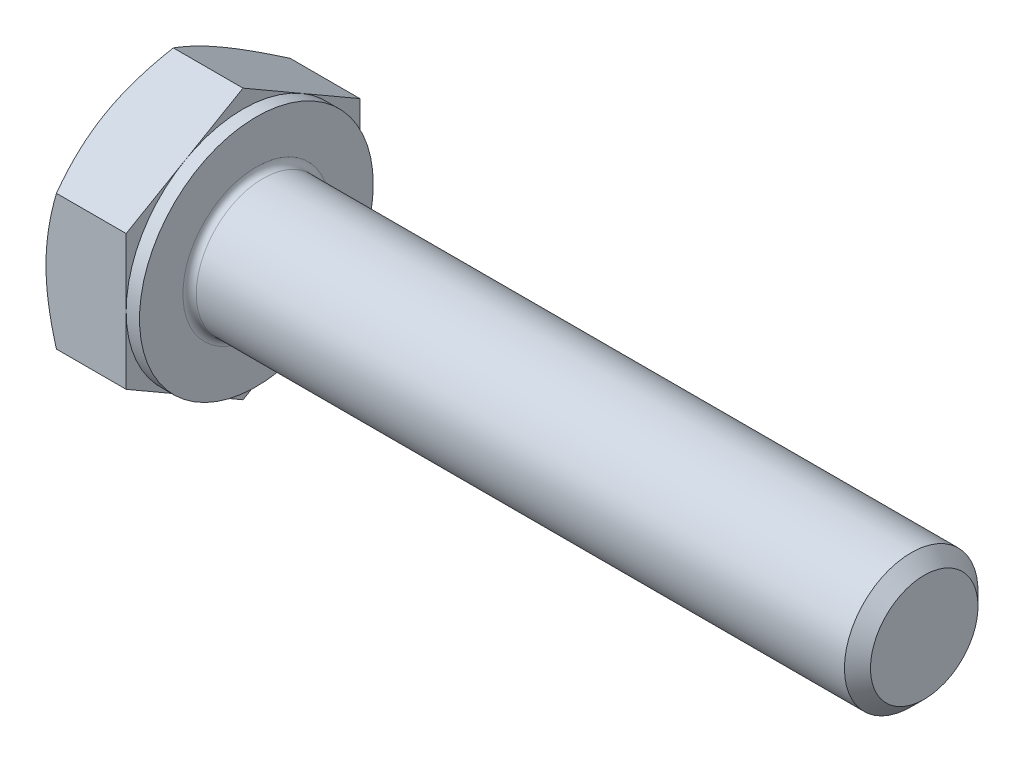
ISO-10303-21;
HEADER;
FILE_DESCRIPTION(('STEP AP214'),'2;1');
FILE_NAME('part.step','',(''),(''),'','','');
FILE_SCHEMA(('AUTOMOTIVE_DESIGN { 1 0 10303 214 1 1 1 1 }'));
ENDSEC;
DATA;
#1=APPLICATION_CONTEXT('core data for automotive mechanical design processes');
#2=APPLICATION_PROTOCOL_DEFINITION('international standard','automotive_design',2000,#1);
#3=PRODUCT_CONTEXT('',#1,'mechanical');
#4=PRODUCT('Part','Part','',(#3));
#5=PRODUCT_RELATED_PRODUCT_CATEGORY('part','',(#4));
#6=PRODUCT_DEFINITION_FORMATION('','',#4);
#7=PRODUCT_DEFINITION_CONTEXT('part definition',#1,'design');
#8=PRODUCT_DEFINITION('design','',#6,#7);
#9=PRODUCT_DEFINITION_SHAPE('','',#8);
#10=(LENGTH_UNIT() NAMED_UNIT(*) SI_UNIT(.MILLI.,.METRE.));
#11=(NAMED_UNIT(*) PLANE_ANGLE_UNIT() SI_UNIT($,.RADIAN.));
#12=(NAMED_UNIT(*) SI_UNIT($,.STERADIAN.) SOLID_ANGLE_UNIT());
#13=UNCERTAINTY_MEASURE_WITH_UNIT(LENGTH_MEASURE(1.E-05),#10,'distance_accuracy_value','');
#14=(GEOMETRIC_REPRESENTATION_CONTEXT(3) GLOBAL_UNCERTAINTY_ASSIGNED_CONTEXT((#13)) GLOBAL_UNIT_ASSIGNED_CONTEXT((#10,
#11,#12)) REPRESENTATION_CONTEXT('',''));
#15=CARTESIAN_POINT('',(0.,0.,0.));
#16=DIRECTION('',(0.,0.,1.));
#17=DIRECTION('',(1.,0.,0.));
#18=AXIS2_PLACEMENT_3D('',#15,#16,#17);
#19=CARTESIAN_POINT('',(2.8,4.04145188432738,0.));
#20=DIRECTION('',(1.,0.,0.));
#21=DIRECTION('',(0.,0.,-1.));
#22=AXIS2_PLACEMENT_3D('',#19,#20,#21);
#23=PLANE('',#22);
#24=CARTESIAN_POINT('',(2.8,0.,0.));
#25=DIRECTION('',(1.,0.,0.));
#26=DIRECTION('',(0.,0.,-1.));
#27=AXIS2_PLACEMENT_3D('',#24,#25,#26);
#28=CIRCLE('',#27,2.2);
#29=CARTESIAN_POINT('',(2.8,0.,-2.2));
#30=VERTEX_POINT('',#29);
#31=EDGE_CURVE('E42',#30,#30,#28,.F.);
#32=ORIENTED_EDGE('',*,*,#31,.T.);
#33=EDGE_LOOP('',(#32));
#34=FACE_BOUND('',#33,.T.);
#35=CARTESIAN_POINT('',(2.8,0.,0.));
#36=DIRECTION('',(1.,0.,0.));
#37=DIRECTION('',(0.,0.,-1.));
#38=AXIS2_PLACEMENT_3D('',#35,#36,#37);
#39=CIRCLE('',#38,3.5);
#40=CARTESIAN_POINT('',(2.8,0.,-3.5));
#41=VERTEX_POINT('',#40);
#42=EDGE_CURVE('E293',#41,#41,#39,.T.);
#43=ORIENTED_EDGE('',*,*,#42,.T.);
#44=EDGE_LOOP('',(#43));
#45=FACE_BOUND('',#44,.T.);
#46=ADVANCED_FACE('F34',(#34,#45),#23,.T.);
#47=CARTESIAN_POINT('',(0.,0.,0.));
#48=DIRECTION('',(-1.,0.,0.));
#49=DIRECTION('',(0.,0.,1.));
#50=AXIS2_PLACEMENT_3D('',#47,#48,#49);
#51=CYLINDRICAL_SURFACE('',#50,2.);
#52=CARTESIAN_POINT('',(3.,0.,0.));
#53=DIRECTION('',(1.,0.,0.));
#54=DIRECTION('',(0.,0.,-1.));
#55=AXIS2_PLACEMENT_3D('',#52,#53,#54);
#56=CIRCLE('',#55,2.);
#57=CARTESIAN_POINT('',(3.,0.,-2.));
#58=VERTEX_POINT('',#57);
#59=EDGE_CURVE('E11',#58,#58,#56,.T.);
#60=ORIENTED_EDGE('',*,*,#59,.T.);
#61=EDGE_LOOP('',(#60));
#62=FACE_BOUND('',#61,.T.);
#63=CARTESIAN_POINT('',(22.41,0.,0.));
#64=DIRECTION('',(-1.,0.,0.));
#65=DIRECTION('',(0.,0.,1.));
#66=AXIS2_PLACEMENT_3D('',#63,#64,#65);
#67=CIRCLE('',#66,2.);
#68=CARTESIAN_POINT('',(22.41,0.,2.));
#69=VERTEX_POINT('',#68);
#70=EDGE_CURVE('E272',#69,#69,#67,.T.);
#71=ORIENTED_EDGE('',*,*,#70,.T.);
#72=EDGE_LOOP('',(#71));
#73=FACE_BOUND('',#72,.T.);
#74=ADVANCED_FACE('F246',(#62,#73),#51,.T.);
#75=CARTESIAN_POINT('',(22.8,0.,0.));
#76=DIRECTION('',(-1.,0.,0.));
#77=DIRECTION('',(0.,0.,1.));
#78=AXIS2_PLACEMENT_3D('',#75,#76,#77);
#79=CONICAL_SURFACE('',#78,1.61,0.785398163397438);
#80=ORIENTED_EDGE('',*,*,#70,.F.);
#81=EDGE_LOOP('',(#80));
#82=FACE_BOUND('',#81,.T.);
#83=CARTESIAN_POINT('',(22.8,0.,0.));
#84=DIRECTION('',(-1.,0.,0.));
#85=DIRECTION('',(0.,0.,1.));
#86=AXIS2_PLACEMENT_3D('',#83,#84,#85);
#87=CIRCLE('',#86,1.61);
#88=CARTESIAN_POINT('',(22.8,0.,1.61));
#89=VERTEX_POINT('',#88);
#90=EDGE_CURVE('E270',#89,#89,#87,.T.);
#91=ORIENTED_EDGE('',*,*,#90,.T.);
#92=EDGE_LOOP('',(#91));
#93=FACE_BOUND('',#92,.T.);
#94=ADVANCED_FACE('F251',(#82,#93),#79,.T.);
#95=CARTESIAN_POINT('',(22.8,0.,0.));
#96=DIRECTION('',(-1.,0.,0.));
#97=DIRECTION('',(0.,0.,1.));
#98=AXIS2_PLACEMENT_3D('',#95,#96,#97);
#99=PLANE('',#98);
#100=ORIENTED_EDGE('',*,*,#90,.F.);
#101=EDGE_LOOP('',(#100));
#102=FACE_BOUND('',#101,.T.);
#103=ADVANCED_FACE('F258',(#102),#99,.F.);
#104=CARTESIAN_POINT('',(2.4,3.5,0.));
#105=DIRECTION('',(1.,0.,0.));
#106=DIRECTION('',(0.,0.,-1.));
#107=AXIS2_PLACEMENT_3D('',#104,#105,#106);
#108=PLANE('',#107);
#109=DIRECTION('',(0.,0.500000000000001,0.866025403784438));
#110=VECTOR('',#109,1.);
#111=CARTESIAN_POINT('',(2.4,2.02072594216369,-3.5));
#112=LINE('',#111,#110);
#113=CARTESIAN_POINT('',(2.4,2.02072594216369,-3.5));
#114=VERTEX_POINT('',#113);
#115=CARTESIAN_POINT('',(2.4,3.03108891324553,-1.75));
#116=VERTEX_POINT('',#115);
#117=EDGE_CURVE('E166',#114,#116,#112,.T.);
#118=ORIENTED_EDGE('',*,*,#117,.T.);
#119=CARTESIAN_POINT('',(2.4,0.,0.));
#120=DIRECTION('',(-1.,0.,0.));
#121=DIRECTION('',(0.,0.,1.));
#122=AXIS2_PLACEMENT_3D('',#119,#120,#121);
#123=CIRCLE('',#122,3.5);
#124=CARTESIAN_POINT('',(2.4,0.,-3.5));
#125=VERTEX_POINT('',#124);
#126=EDGE_CURVE('E49',#116,#125,#123,.T.);
#127=ORIENTED_EDGE('',*,*,#126,.T.);
#128=DIRECTION('',(0.,1.,0.));
#129=VECTOR('',#128,1.);
#130=CARTESIAN_POINT('',(2.4,2.02072594216369,-3.5));
#131=LINE('',#130,#129);
#132=EDGE_CURVE('E296',#125,#114,#131,.T.);
#133=ORIENTED_EDGE('',*,*,#132,.T.);
#134=EDGE_LOOP('',(#118,#127,#133));
#135=FACE_BOUND('',#134,.T.);
#136=ADVANCED_FACE('F261',(#135),#108,.T.);
#137=CARTESIAN_POINT('',(2.4,4.04145188432738,0.));
#138=VERTEX_POINT('',#137);
#139=EDGE_CURVE('E164',#116,#138,#112,.T.);
#140=ORIENTED_EDGE('',*,*,#139,.T.);
#141=DIRECTION('',(0.,-0.500000000000001,0.866025403784438));
#142=VECTOR('',#141,1.);
#143=CARTESIAN_POINT('',(2.4,4.04145188432738,0.));
#144=LINE('',#143,#142);
#145=CARTESIAN_POINT('',(2.4,3.03108891324553,1.75));
#146=VERTEX_POINT('',#145);
#147=EDGE_CURVE('E163',#138,#146,#144,.T.);
#148=ORIENTED_EDGE('',*,*,#147,.T.);
#149=EDGE_CURVE('E152',#146,#116,#123,.T.);
#150=ORIENTED_EDGE('',*,*,#149,.T.);
#151=EDGE_LOOP('',(#140,#148,#150));
#152=FACE_BOUND('',#151,.T.);
#153=ADVANCED_FACE('F266',(#152),#108,.T.);
#154=CARTESIAN_POINT('',(2.4,2.02072594216369,3.5));
#155=VERTEX_POINT('',#154);
#156=EDGE_CURVE('E131',#146,#155,#144,.T.);
#157=ORIENTED_EDGE('',*,*,#156,.T.);
#158=DIRECTION('',(0.,-1.,0.));
#159=VECTOR('',#158,1.);
#160=CARTESIAN_POINT('',(2.4,2.02072594216369,3.5));
#161=LINE('',#160,#159);
#162=CARTESIAN_POINT('',(2.4,0.,3.5));
#163=VERTEX_POINT('',#162);
#164=EDGE_CURVE('E125',#155,#163,#161,.T.);
#165=ORIENTED_EDGE('',*,*,#164,.T.);
#166=EDGE_CURVE('E129',#163,#146,#123,.T.);
#167=ORIENTED_EDGE('',*,*,#166,.T.);
#168=EDGE_LOOP('',(#157,#165,#167));
#169=FACE_BOUND('',#168,.T.);
#170=ADVANCED_FACE('F127',(#169),#108,.T.);
#171=CARTESIAN_POINT('',(2.4,-2.02072594216369,3.5));
#172=VERTEX_POINT('',#171);
#173=EDGE_CURVE('E135',#163,#172,#161,.T.);
#174=ORIENTED_EDGE('',*,*,#173,.T.);
#175=DIRECTION('',(0.,-0.500000000000001,-0.866025403784438));
#176=VECTOR('',#175,1.);
#177=CARTESIAN_POINT('',(2.4,-4.04145188432739,0.));
#178=LINE('',#177,#176);
#179=CARTESIAN_POINT('',(2.4,-3.03108891324553,1.75));
#180=VERTEX_POINT('',#179);
#181=EDGE_CURVE('E142',#172,#180,#178,.T.);
#182=ORIENTED_EDGE('',*,*,#181,.T.);
#183=EDGE_CURVE('E139',#180,#163,#123,.T.);
#184=ORIENTED_EDGE('',*,*,#183,.T.);
#185=EDGE_LOOP('',(#174,#182,#184));
#186=FACE_BOUND('',#185,.T.);
#187=ADVANCED_FACE('F140',(#186),#108,.T.);
#188=CARTESIAN_POINT('',(2.4,-4.04145188432739,0.));
#189=VERTEX_POINT('',#188);
#190=EDGE_CURVE('E158',#180,#189,#178,.T.);
#191=ORIENTED_EDGE('',*,*,#190,.T.);
#192=DIRECTION('',(0.,0.500000000000001,-0.866025403784438));
#193=VECTOR('',#192,1.);
#194=CARTESIAN_POINT('',(2.4,-2.0207259421637,-3.5));
#195=LINE('',#194,#193);
#196=CARTESIAN_POINT('',(2.4,-3.03108891324553,-1.75));
#197=VERTEX_POINT('',#196);
#198=EDGE_CURVE('E334',#189,#197,#195,.T.);
#199=ORIENTED_EDGE('',*,*,#198,.T.);
#200=EDGE_CURVE('E146',#197,#180,#123,.T.);
#201=ORIENTED_EDGE('',*,*,#200,.T.);
#202=EDGE_LOOP('',(#191,#199,#201));
#203=FACE_BOUND('',#202,.T.);
#204=ADVANCED_FACE('F335',(#203),#108,.T.);
#205=CARTESIAN_POINT('',(2.4,-2.0207259421637,-3.5));
#206=VERTEX_POINT('',#205);
#207=EDGE_CURVE('E153',#197,#206,#195,.T.);
#208=ORIENTED_EDGE('',*,*,#207,.T.);
#209=EDGE_CURVE('E297',#206,#125,#131,.T.);
#210=ORIENTED_EDGE('',*,*,#209,.T.);
#211=EDGE_CURVE('E304',#125,#197,#123,.T.);
#212=ORIENTED_EDGE('',*,*,#211,.T.);
#213=EDGE_LOOP('',(#208,#210,#212));
#214=FACE_BOUND('',#213,.T.);
#215=ADVANCED_FACE('F267',(#214),#108,.T.);
#216=CARTESIAN_POINT('',(0.,0.,0.));
#217=DIRECTION('',(-1.,0.,0.));
#218=DIRECTION('',(0.,0.,1.));
#219=AXIS2_PLACEMENT_3D('',#216,#217,#218);
#220=CYLINDRICAL_SURFACE('',#219,3.5);
#221=ORIENTED_EDGE('',*,*,#126,.F.);
#222=ORIENTED_EDGE('',*,*,#149,.F.);
#223=ORIENTED_EDGE('',*,*,#166,.F.);
#224=ORIENTED_EDGE('',*,*,#183,.F.);
#225=ORIENTED_EDGE('',*,*,#200,.F.);
#226=ORIENTED_EDGE('',*,*,#211,.F.);
#227=EDGE_LOOP('',(#221,#222,#223,#224,#225,#226));
#228=FACE_BOUND('',#227,.T.);
#229=ORIENTED_EDGE('',*,*,#42,.F.);
#230=EDGE_LOOP('',(#229));
#231=FACE_BOUND('',#230,.T.);
#232=ADVANCED_FACE('F149',(#228,#231),#220,.T.);
#233=CARTESIAN_POINT('',(0.,4.04145188432738,0.));
#234=DIRECTION('',(1.,0.,0.));
#235=DIRECTION('',(0.,0.,-1.));
#236=AXIS2_PLACEMENT_3D('',#233,#234,#235);
#237=PLANE('',#236);
#238=CARTESIAN_POINT('',(0.,0.,0.));
#239=DIRECTION('',(1.,0.,0.));
#240=DIRECTION('',(0.,0.,-1.));
#241=AXIS2_PLACEMENT_3D('',#238,#239,#240);
#242=CIRCLE('',#241,3.5);
#243=CARTESIAN_POINT('',(0.,0.,-3.5));
#244=VERTEX_POINT('',#243);
#245=CARTESIAN_POINT('',(0.,3.03108891324553,-1.75));
#246=VERTEX_POINT('',#245);
#247=EDGE_CURVE('E292',#244,#246,#242,.T.);
#248=ORIENTED_EDGE('',*,*,#247,.F.);
#249=CARTESIAN_POINT('',(0.,-3.03108891324553,-1.75));
#250=VERTEX_POINT('',#249);
#251=EDGE_CURVE('E288',#250,#244,#242,.T.);
#252=ORIENTED_EDGE('',*,*,#251,.F.);
#253=CARTESIAN_POINT('',(0.,-3.03108891324553,1.75));
#254=VERTEX_POINT('',#253);
#255=EDGE_CURVE('E291',#254,#250,#242,.T.);
#256=ORIENTED_EDGE('',*,*,#255,.F.);
#257=CARTESIAN_POINT('',(0.,0.,3.5));
#258=VERTEX_POINT('',#257);
#259=EDGE_CURVE('E327',#258,#254,#242,.T.);
#260=ORIENTED_EDGE('',*,*,#259,.F.);
#261=CARTESIAN_POINT('',(0.,0.,0.));
#262=DIRECTION('',(-1.,0.,0.));
#263=DIRECTION('',(0.,0.,1.));
#264=AXIS2_PLACEMENT_3D('',#261,#262,#263);
#265=CIRCLE('',#264,3.5);
#266=CARTESIAN_POINT('',(0.,3.03108891324553,1.75));
#267=VERTEX_POINT('',#266);
#268=EDGE_CURVE('E167',#258,#267,#265,.T.);
#269=ORIENTED_EDGE('',*,*,#268,.T.);
#270=EDGE_CURVE('E350',#246,#267,#242,.T.);
#271=ORIENTED_EDGE('',*,*,#270,.F.);
#272=EDGE_LOOP('',(#248,#252,#256,#260,#269,#271));
#273=FACE_BOUND('',#272,.T.);
#274=ADVANCED_FACE('F196',(#273),#237,.F.);
#275=CARTESIAN_POINT('',(0.,0.,0.));
#276=DIRECTION('',(1.,0.,0.));
#277=DIRECTION('',(0.,0.,-1.));
#278=AXIS2_PLACEMENT_3D('',#275,#276,#277);
#279=CONICAL_SURFACE('',#278,3.5,1.0471975511966);
#280=CARTESIAN_POINT('',(0.312674060693369,2.02061047210985,3.5002));
#281=CARTESIAN_POINT('',(0.261385788989982,2.10941108799267,3.34639282154755));
#282=CARTESIAN_POINT('',(0.214740953816195,2.19897822522909,3.19125798916558));
#283=CARTESIAN_POINT('',(0.133321875533347,2.37966345361545,2.87830199342322));
#284=CARTESIAN_POINT('',(0.0985764355845601,2.47078475532382,2.7204752692125));
#285=CARTESIAN_POINT('',(0.0444900271828353,2.65189807961073,2.40677778961987));
#286=CARTESIAN_POINT('',(0.0247890862603811,2.74186223545399,2.25095530083931));
#287=CARTESIAN_POINT('',(0.00127013273725424,2.92221386641056,1.93857711279463));
#288=CARTESIAN_POINT('',(-0.00256735545443494,3.01260068598001,1.78202254896577));
#289=CARTESIAN_POINT('',(0.00541530187697759,3.1814939814933,1.48949078007901));
#290=CARTESIAN_POINT('',(0.0152754340696072,3.26002573814993,1.3534697875421));
#291=CARTESIAN_POINT('',(0.0465264668994038,3.41657761679354,1.08231397971101));
#292=CARTESIAN_POINT('',(0.0679280432857985,3.49459719728458,0.947180102315319));
#293=CARTESIAN_POINT('',(0.121430407880577,3.65147186489429,0.675465207594817));
#294=CARTESIAN_POINT('',(0.153757994445087,3.73030709667644,0.538918580721665));
#295=CARTESIAN_POINT('',(0.227128933807994,3.88680174018324,0.267861907055499));
#296=CARTESIAN_POINT('',(0.268155046569867,3.96446315689009,0.133348387531464));
#297=CARTESIAN_POINT('',(0.312674060693371,4.04156735438122,-0.00020000000000006));
#298=B_SPLINE_CURVE_WITH_KNOTS('',3,(#280,#281,#282,#283,#284,#285,#286,#287,#288,#289,#290,
#291,#292,#293,#294,#295,#296,#297),.UNSPECIFIED.,.F.,.F.,(4,2,2,2,2,2,2,2,4),(0.,
0.554793832886254,1.11092123814984,1.65328467083219,2.19498204478403,2.6666513085086,
3.13875761298267,3.6213361260051,4.10296698719187),.UNSPECIFIED.);
#299=CARTESIAN_POINT('',(0.312607391169643,4.04145188432738,0.));
#300=VERTEX_POINT('',#299);
#301=EDGE_CURVE('E215',#267,#300,#298,.T.);
#302=ORIENTED_EDGE('',*,*,#301,.T.);
#303=CARTESIAN_POINT('',(0.312674060693371,4.04156735438122,0.000199999999999895));
#304=CARTESIAN_POINT('',(0.261385788989984,3.9527667384984,-0.15360717845245));
#305=CARTESIAN_POINT('',(0.214740953816197,3.86319960126198,-0.308742010834424));
#306=CARTESIAN_POINT('',(0.133321875533349,3.68251437287562,-0.621698006576781));
#307=CARTESIAN_POINT('',(0.0985764355845619,3.59139307116725,-0.779524730787496));
#308=CARTESIAN_POINT('',(0.0444900271828364,3.41027974688034,-1.09322221038013));
#309=CARTESIAN_POINT('',(0.0247890862603818,3.32031559103708,-1.24904469916069));
#310=CARTESIAN_POINT('',(0.00127013273725429,3.13996396008052,-1.56142288720537));
#311=CARTESIAN_POINT('',(-0.00256735545443505,3.04957714051106,-1.71797745103423));
#312=CARTESIAN_POINT('',(0.00541530187697722,2.88068384499777,-2.01050921992099));
#313=CARTESIAN_POINT('',(0.0152754340696067,2.80215208834114,-2.14653021245791));
#314=CARTESIAN_POINT('',(0.0465264668994028,2.64560020969753,-2.41768602028899));
#315=CARTESIAN_POINT('',(0.0679280432857971,2.56758062920649,-2.55281989768468));
#316=CARTESIAN_POINT('',(0.121430407880576,2.41070596159678,-2.82453479240518));
#317=CARTESIAN_POINT('',(0.153757994445085,2.33187072981463,-2.96108141927834));
#318=CARTESIAN_POINT('',(0.227128933807992,2.17537608630783,-3.2321380929445));
#319=CARTESIAN_POINT('',(0.268155046569865,2.09771466960098,-3.36665161246854));
#320=CARTESIAN_POINT('',(0.312674060693368,2.02061047210985,-3.5002));
#321=B_SPLINE_CURVE_WITH_KNOTS('',3,(#303,#304,#305,#306,#307,#308,#309,#310,#311,#312,#313,
#314,#315,#316,#317,#318,#319,#320),.UNSPECIFIED.,.F.,.F.,(4,2,2,2,2,2,2,2,4),(0.,
0.554793832886254,1.11092123814984,1.65328467083219,2.19498204478403,2.6666513085086,
3.13875761298267,3.6213361260051,4.10296698719187),.UNSPECIFIED.);
#322=EDGE_CURVE('E57',#300,#246,#321,.T.);
#323=ORIENTED_EDGE('',*,*,#322,.T.);
#324=ORIENTED_EDGE('',*,*,#270,.T.);
#325=EDGE_LOOP('',(#302,#323,#324));
#326=FACE_BOUND('',#325,.T.);
#327=ADVANCED_FACE('F351',(#326),#279,.T.);
#328=CARTESIAN_POINT('',(1.74876972324083,-5.51155991662167,3.5));
#329=CARTESIAN_POINT('',(1.6739233606435,-5.35795146497443,3.5));
#330=CARTESIAN_POINT('',(1.59977092634847,-5.20399921327067,3.5));
#331=CARTESIAN_POINT('',(1.45324265223558,-4.89522455167779,3.5));
#332=CARTESIAN_POINT('',(1.38086707701141,-4.74040201636208,3.5));
#333=CARTESIAN_POINT('',(1.23793493399994,-4.42894615294239,3.5));
#334=CARTESIAN_POINT('',(1.1673897119315,-4.27230760071022,3.5));
#335=CARTESIAN_POINT('',(1.02907715201446,-3.95781335407225,3.5));
#336=CARTESIAN_POINT('',(0.961309688205799,-3.7999577152429,3.5));
#337=CARTESIAN_POINT('',(0.827049258068264,-3.4774111334268,3.5));
#338=CARTESIAN_POINT('',(0.760677040301392,-3.3126696619141,3.5));
#339=CARTESIAN_POINT('',(0.6327563912226,-2.98129055334351,3.5));
#340=CARTESIAN_POINT('',(0.57120848924097,-2.81465271050397,3.5));
#341=CARTESIAN_POINT('',(0.454490935593631,-2.47950135142084,3.5));
#342=CARTESIAN_POINT('',(0.399309072522248,-2.3109921296124,3.5));
#343=CARTESIAN_POINT('',(0.297038623207368,-1.97155788075463,3.5));
#344=CARTESIAN_POINT('',(0.249947575461083,-1.80063360563483,3.5));
#345=CARTESIAN_POINT('',(0.166312731904446,-1.45721769442351,3.5));
#346=CARTESIAN_POINT('',(0.129709932809731,-1.28474069132431,3.5));
#347=CARTESIAN_POINT('',(0.0690664437905979,-0.937557024710317,3.5));
#348=CARTESIAN_POINT('',(0.045024387782383,-0.762850605780841,3.5));
#349=CARTESIAN_POINT('',(0.0117307990577607,-0.414396255839323,3.5));
#350=CARTESIAN_POINT('',(0.0022826057682424,-0.240667591359061,3.5));
#351=CARTESIAN_POINT('',(-0.00154556657178767,0.106974361978117,3.5));
#352=CARTESIAN_POINT('',(0.00407467653682698,0.280887653519264,3.5));
#353=CARTESIAN_POINT('',(0.0258160056757239,0.573677732069624,3.5));
#354=CARTESIAN_POINT('',(0.0381294865222868,0.692856455403476,3.5));
#355=CARTESIAN_POINT('',(0.0691104276210827,0.930390572672181,3.5));
#356=CARTESIAN_POINT('',(0.0877786805228833,1.04874586201748,3.5));
#357=CARTESIAN_POINT('',(0.152339395828372,1.40238821330865,3.5));
#358=CARTESIAN_POINT('',(0.206777964761842,1.63613518289362,3.5));
#359=CARTESIAN_POINT('',(0.301818253779736,1.9858404099606,3.5));
#360=CARTESIAN_POINT('',(0.336200478121234,2.10359260845122,3.5));
#361=CARTESIAN_POINT('',(0.40869422617953,2.33795453185624,3.5));
#362=CARTESIAN_POINT('',(0.446805778664187,2.45456424794997,3.5));
#363=CARTESIAN_POINT('',(0.526133501179592,2.68667648799218,3.5));
#364=CARTESIAN_POINT('',(0.567348797905201,2.80217931315364,3.5));
#365=CARTESIAN_POINT('',(0.652383319257554,3.03221622488002,3.5));
#366=CARTESIAN_POINT('',(0.696202484064561,3.14675033363065,3.5));
#367=CARTESIAN_POINT('',(0.817586420524251,3.45518824791985,3.5));
#368=CARTESIAN_POINT('',(0.897216284270023,3.64827858653487,3.5));
#369=CARTESIAN_POINT('',(1.06116121789352,4.03246734047173,3.5));
#370=CARTESIAN_POINT('',(1.1454768097731,4.22356553103576,3.5));
#371=CARTESIAN_POINT('',(1.31768022516432,4.60422080385886,3.5));
#372=CARTESIAN_POINT('',(1.40556928969841,4.79377732281036,3.5));
#373=CARTESIAN_POINT('',(1.58407294349369,5.17160543290685,3.5));
#374=CARTESIAN_POINT('',(1.67468761675268,5.35987698423189,3.5));
#375=CARTESIAN_POINT('',(1.85818750995007,5.73567568482784,3.5));
#376=CARTESIAN_POINT('',(1.95107608308063,5.92320119337956,3.5));
#377=CARTESIAN_POINT('',(2.13854805180964,6.29740401627919,3.5));
#378=CARTESIAN_POINT('',(2.23313146548459,6.48408132155384,3.5));
#379=CARTESIAN_POINT('',(2.51886265052555,7.04299370869451,3.5));
#380=CARTESIAN_POINT('',(2.71203324279836,7.41419418882235,3.5));
#381=CARTESIAN_POINT('',(3.08131090922903,8.11545297659331,3.5));
#382=CARTESIAN_POINT('',(3.257056800529,8.44570240889787,3.5));
#383=CARTESIAN_POINT('',(3.61066708174042,9.10509095555402,3.5));
#384=CARTESIAN_POINT('',(3.78853160254258,9.43422999967597,3.5));
#385=CARTESIAN_POINT('',(4.14522643287858,10.0905480477554,3.5));
#386=CARTESIAN_POINT('',(4.32405147354835,10.4177299197431,3.5));
#387=CARTESIAN_POINT('',(4.68290305461308,11.0714005829853,3.5));
#388=CARTESIAN_POINT('',(4.86292949853349,11.3978894271807,3.5));
#389=CARTESIAN_POINT('',(5.04339321876768,11.7241348746726,3.5));
#390=B_SPLINE_CURVE_WITH_KNOTS('',3,(#328,#329,#330,#331,#332,#333,#334,#335,#336,#337,#338,
#339,#340,#341,#342,#343,#344,#345,#346,#347,#348,#349,#350,#351,#352,#353,#354,#355,#356,#357,
#358,#359,#360,#361,#362,#363,#364,#365,#366,#367,#368,#369,#370,#371,#372,#373,#374,#375,#376,
#377,#378,#379,#380,#381,#382,#383,#384,#385,#386,#387,#388,#389),.UNSPECIFIED.,.F.,.F.,(4,2,2,
2,2,2,2,2,2,2,2,2,2,2,2,2,2,2,2,2,2,2,2,2,2,2,2,2,2,2,4),(0.,0.512624455455558,1.02532478887103,
1.54067716699584,2.05600615007007,2.58877526866933,3.12160276180877,3.65339055960882,
4.18501628177853,4.71358975001966,5.24210571958899,5.76343550668359,6.28477297996432,
6.64403977825953,7.00335140539848,7.72232402673615,8.09029790450666,8.45827462103385,
8.82614818350625,9.19401329793224,9.82051720822946,10.4470910530887,11.0738843896344,
11.7006970625238,12.3284975533834,12.9563047441025,14.211635085947,15.33392926628,
16.4562931462709,17.574877685398,18.6933734561263),.UNSPECIFIED.);
#391=CARTESIAN_POINT('',(0.312607391169641,2.02072594216369,3.5));
#392=VERTEX_POINT('',#391);
#393=EDGE_CURVE('E227',#258,#392,#390,.T.);
#394=ORIENTED_EDGE('',*,*,#393,.T.);
#395=EDGE_CURVE('E226',#392,#267,#298,.T.);
#396=ORIENTED_EDGE('',*,*,#395,.T.);
#397=ORIENTED_EDGE('',*,*,#268,.F.);
#398=EDGE_LOOP('',(#394,#396,#397));
#399=FACE_BOUND('',#398,.T.);
#400=ADVANCED_FACE('F321',(#399),#279,.T.);
#401=CARTESIAN_POINT('',(0.312607391169643,-2.02072594216369,3.5));
#402=VERTEX_POINT('',#401);
#403=EDGE_CURVE('E273',#402,#258,#390,.T.);
#404=ORIENTED_EDGE('',*,*,#403,.T.);
#405=ORIENTED_EDGE('',*,*,#259,.T.);
#406=CARTESIAN_POINT('',(0.312674060693375,-4.04156735438123,-0.000199999999999996));
#407=CARTESIAN_POINT('',(0.261385788989988,-3.95276673849841,0.15360717845245));
#408=CARTESIAN_POINT('',(0.214740953816201,-3.86319960126199,0.308742010834424));
#409=CARTESIAN_POINT('',(0.133321875533353,-3.68251437287563,0.621698006576782));
#410=CARTESIAN_POINT('',(0.0985764355845653,-3.59139307116726,0.779524730787497));
#411=CARTESIAN_POINT('',(0.0444900271828397,-3.41027974688034,1.09322221038013));
#412=CARTESIAN_POINT('',(0.0247890862603851,-3.32031559103709,1.24904469916069));
#413=CARTESIAN_POINT('',(0.00127013273725765,-3.13996396008052,1.56142288720538));
#414=CARTESIAN_POINT('',(-0.00256735545443167,-3.04957714051107,1.71797745103423));
#415=CARTESIAN_POINT('',(0.00541530187698058,-2.88068384499778,2.01050921992099));
#416=CARTESIAN_POINT('',(0.0152754340696099,-2.80215208834115,2.14653021245791));
#417=CARTESIAN_POINT('',(0.0465264668994058,-2.64560020969754,2.417686020289));
#418=CARTESIAN_POINT('',(0.0679280432858,-2.5675806292065,2.55281989768468));
#419=CARTESIAN_POINT('',(0.121430407880578,-2.41070596159679,2.82453479240518));
#420=CARTESIAN_POINT('',(0.153757994445088,-2.33187072981464,2.96108141927834));
#421=CARTESIAN_POINT('',(0.227128933807994,-2.17537608630783,3.2321380929445));
#422=CARTESIAN_POINT('',(0.268155046569867,-2.09771466960099,3.36665161246854));
#423=CARTESIAN_POINT('',(0.31267406069337,-2.02061047210986,3.5002));
#424=B_SPLINE_CURVE_WITH_KNOTS('',3,(#406,#407,#408,#409,#410,#411,#412,#413,#414,#415,#416,
#417,#418,#419,#420,#421,#422,#423),.UNSPECIFIED.,.F.,.F.,(4,2,2,2,2,2,2,2,4),(0.,
0.554793832886255,1.11092123814984,1.65328467083219,2.19498204478404,2.6666513085086,
3.13875761298268,3.6213361260051,4.10296698719187),.UNSPECIFIED.);
#425=EDGE_CURVE('E217',#254,#402,#424,.T.);
#426=ORIENTED_EDGE('',*,*,#425,.T.);
#427=EDGE_LOOP('',(#404,#405,#426));
#428=FACE_BOUND('',#427,.T.);
#429=ADVANCED_FACE('F185',(#428),#279,.T.);
#430=CARTESIAN_POINT('',(0.312607391169647,-4.04145188432739,0.));
#431=VERTEX_POINT('',#430);
#432=EDGE_CURVE('E210',#431,#254,#424,.T.);
#433=ORIENTED_EDGE('',*,*,#432,.T.);
#434=ORIENTED_EDGE('',*,*,#255,.T.);
#435=CARTESIAN_POINT('',(0.312674060693371,-2.02061047210986,-3.5002));
#436=CARTESIAN_POINT('',(0.261385788989984,-2.10941108799268,-3.34639282154755));
#437=CARTESIAN_POINT('',(0.214740953816198,-2.1989782252291,-3.19125798916558));
#438=CARTESIAN_POINT('',(0.13332187553335,-2.37966345361546,-2.87830199342322));
#439=CARTESIAN_POINT('',(0.0985764355845631,-2.47078475532383,-2.7204752692125));
#440=CARTESIAN_POINT('',(0.0444900271828385,-2.65189807961074,-2.40677778961987));
#441=CARTESIAN_POINT('',(0.0247890862603843,-2.741862235454,-2.25095530083931));
#442=CARTESIAN_POINT('',(0.00127013273725778,-2.92221386641056,-1.93857711279463));
#443=CARTESIAN_POINT('',(-0.00256735545443114,-3.01260068598002,-1.78202254896577));
#444=CARTESIAN_POINT('',(0.00541530187698166,-3.18149398149331,-1.48949078007901));
#445=CARTESIAN_POINT('',(0.0152754340696112,-3.26002573814994,-1.35346978754209));
#446=CARTESIAN_POINT('',(0.046526466899408,-3.41657761679354,-1.08231397971101));
#447=CARTESIAN_POINT('',(0.0679280432858028,-3.49459719728458,-0.947180102315317));
#448=CARTESIAN_POINT('',(0.121430407880582,-3.6514718648943,-0.675465207594816));
#449=CARTESIAN_POINT('',(0.153757994445091,-3.73030709667645,-0.538918580721664));
#450=CARTESIAN_POINT('',(0.227128933807998,-3.88680174018325,-0.267861907055498));
#451=CARTESIAN_POINT('',(0.268155046569871,-3.9644631568901,-0.133348387531463));
#452=CARTESIAN_POINT('',(0.312674060693375,-4.04156735438123,0.000200000000000379));
#453=B_SPLINE_CURVE_WITH_KNOTS('',3,(#435,#436,#437,#438,#439,#440,#441,#442,#443,#444,#445,
#446,#447,#448,#449,#450,#451,#452),.UNSPECIFIED.,.F.,.F.,(4,2,2,2,2,2,2,2,4),(0.,
0.554793832886254,1.11092123814984,1.65328467083219,2.19498204478403,2.6666513085086,
3.13875761298267,3.6213361260051,4.10296698719187),.UNSPECIFIED.);
#454=EDGE_CURVE('E216',#250,#431,#453,.T.);
#455=ORIENTED_EDGE('',*,*,#454,.T.);
#456=EDGE_LOOP('',(#433,#434,#455));
#457=FACE_BOUND('',#456,.T.);
#458=ADVANCED_FACE('F349',(#457),#279,.T.);
#459=CARTESIAN_POINT('',(0.312607391169641,2.02072594216369,-3.5));
#460=VERTEX_POINT('',#459);
#461=EDGE_CURVE('E218',#246,#460,#321,.T.);
#462=ORIENTED_EDGE('',*,*,#461,.T.);
#463=CARTESIAN_POINT('',(1.74876972324083,-5.51155991662167,-3.5));
#464=CARTESIAN_POINT('',(1.6739233606435,-5.35795146497443,-3.5));
#465=CARTESIAN_POINT('',(1.59977092634847,-5.20399921327068,-3.5));
#466=CARTESIAN_POINT('',(1.45324265223558,-4.89522455167779,-3.5));
#467=CARTESIAN_POINT('',(1.38086707701141,-4.74040201636208,-3.5));
#468=CARTESIAN_POINT('',(1.23793493399994,-4.4289461529424,-3.5));
#469=CARTESIAN_POINT('',(1.1673897119315,-4.27230760071022,-3.5));
#470=CARTESIAN_POINT('',(1.02907715201446,-3.95781335407225,-3.5));
#471=CARTESIAN_POINT('',(0.9613096882058,-3.79995771524291,-3.5));
#472=CARTESIAN_POINT('',(0.827049258068264,-3.4774111334268,-3.5));
#473=CARTESIAN_POINT('',(0.760677040301393,-3.3126696619141,-3.5));
#474=CARTESIAN_POINT('',(0.632756391222601,-2.98129055334351,-3.5));
#475=CARTESIAN_POINT('',(0.571208489240971,-2.81465271050398,-3.5));
#476=CARTESIAN_POINT('',(0.454490935593631,-2.47950135142084,-3.5));
#477=CARTESIAN_POINT('',(0.399309072522248,-2.3109921296124,-3.5));
#478=CARTESIAN_POINT('',(0.297038623207368,-1.97155788075463,-3.5));
#479=CARTESIAN_POINT('',(0.249947575461083,-1.80063360563483,-3.5));
#480=CARTESIAN_POINT('',(0.166312731904446,-1.45721769442351,-3.5));
#481=CARTESIAN_POINT('',(0.129709932809731,-1.28474069132431,-3.5));
#482=CARTESIAN_POINT('',(0.069066443790598,-0.937557024710317,-3.5));
#483=CARTESIAN_POINT('',(0.0450243877823832,-0.762850605780841,-3.5));
#484=CARTESIAN_POINT('',(0.0117307990577608,-0.414396255839323,-3.5));
#485=CARTESIAN_POINT('',(0.00228260576824221,-0.240667591359061,-3.5));
#486=CARTESIAN_POINT('',(-0.00154556657178774,0.106974361978117,-3.5));
#487=CARTESIAN_POINT('',(0.00407467653682721,0.280887653519264,-3.5));
#488=CARTESIAN_POINT('',(0.025816005675724,0.573677732069624,-3.5));
#489=CARTESIAN_POINT('',(0.0381294865222867,0.692856455403475,-3.5));
#490=CARTESIAN_POINT('',(0.0691104276210826,0.93039057267218,-3.5));
#491=CARTESIAN_POINT('',(0.0877786805228834,1.04874586201748,-3.5));
#492=CARTESIAN_POINT('',(0.152339395828373,1.40238821330865,-3.5));
#493=CARTESIAN_POINT('',(0.206777964761842,1.63613518289362,-3.5));
#494=CARTESIAN_POINT('',(0.301818253779735,1.9858404099606,-3.5));
#495=CARTESIAN_POINT('',(0.336200478121233,2.10359260845122,-3.5));
#496=CARTESIAN_POINT('',(0.40869422617953,2.33795453185624,-3.5));
#497=CARTESIAN_POINT('',(0.446805778664187,2.45456424794997,-3.5));
#498=CARTESIAN_POINT('',(0.526133501179593,2.68667648799218,-3.5));
#499=CARTESIAN_POINT('',(0.567348797905202,2.80217931315365,-3.5));
#500=CARTESIAN_POINT('',(0.652383319257555,3.03221622488002,-3.5));
#501=CARTESIAN_POINT('',(0.696202484064562,3.14675033363065,-3.5));
#502=CARTESIAN_POINT('',(0.817586420524251,3.45518824791985,-3.5));
#503=CARTESIAN_POINT('',(0.897216284270023,3.64827858653487,-3.5));
#504=CARTESIAN_POINT('',(1.06116121789352,4.03246734047174,-3.5));
#505=CARTESIAN_POINT('',(1.1454768097731,4.22356553103576,-3.5));
#506=CARTESIAN_POINT('',(1.31768022516433,4.60422080385887,-3.5));
#507=CARTESIAN_POINT('',(1.40556928969842,4.79377732281036,-3.5));
#508=CARTESIAN_POINT('',(1.5840729434937,5.17160543290685,-3.5));
#509=CARTESIAN_POINT('',(1.67468761675268,5.35987698423189,-3.5));
#510=CARTESIAN_POINT('',(1.85818750995007,5.73567568482784,-3.5));
#511=CARTESIAN_POINT('',(1.95107608308063,5.92320119337956,-3.5));
#512=CARTESIAN_POINT('',(2.13854805180964,6.29740401627919,-3.5));
#513=CARTESIAN_POINT('',(2.23313146548459,6.48408132155384,-3.5));
#514=CARTESIAN_POINT('',(2.51886265052555,7.04299370869452,-3.5));
#515=CARTESIAN_POINT('',(2.71203324279836,7.41419418882236,-3.5));
#516=CARTESIAN_POINT('',(3.08131090922904,8.11545297659332,-3.5));
#517=CARTESIAN_POINT('',(3.257056800529,8.44570240889787,-3.5));
#518=CARTESIAN_POINT('',(3.61066708174042,9.10509095555402,-3.5));
#519=CARTESIAN_POINT('',(3.78853160254258,9.43422999967597,-3.5));
#520=CARTESIAN_POINT('',(4.14522643287858,10.0905480477554,-3.5));
#521=CARTESIAN_POINT('',(4.32405147354836,10.4177299197431,-3.5));
#522=CARTESIAN_POINT('',(4.68290305461308,11.0714005829853,-3.5));
#523=CARTESIAN_POINT('',(4.8629294985335,11.3978894271807,-3.5));
#524=CARTESIAN_POINT('',(5.04339321876769,11.7241348746726,-3.5));
#525=B_SPLINE_CURVE_WITH_KNOTS('',3,(#463,#464,#465,#466,#467,#468,#469,#470,#471,#472,#473,
#474,#475,#476,#477,#478,#479,#480,#481,#482,#483,#484,#485,#486,#487,#488,#489,#490,#491,#492,
#493,#494,#495,#496,#497,#498,#499,#500,#501,#502,#503,#504,#505,#506,#507,#508,#509,#510,#511,
#512,#513,#514,#515,#516,#517,#518,#519,#520,#521,#522,#523,#524),.UNSPECIFIED.,.F.,.F.,(4,2,2,
2,2,2,2,2,2,2,2,2,2,2,2,2,2,2,2,2,2,2,2,2,2,2,2,2,2,2,4),(0.,0.512624455455558,1.02532478887103,
1.54067716699584,2.05600615007007,2.58877526866933,3.12160276180877,3.65339055960882,
4.18501628177853,4.71358975001967,5.24210571958899,5.76343550668359,6.28477297996433,
6.64403977825953,7.00335140539849,7.72232402673616,8.09029790450667,8.45827462103385,
8.82614818350626,9.19401329793224,9.82051720822947,10.4470910530887,11.0738843896344,
11.7006970625238,12.3284975533834,12.9563047441025,14.211635085947,15.3339292662801,
16.4562931462709,17.574877685398,18.6933734561263),.UNSPECIFIED.);
#526=EDGE_CURVE('E178',#460,#244,#525,.F.);
#527=ORIENTED_EDGE('',*,*,#526,.T.);
#528=ORIENTED_EDGE('',*,*,#247,.T.);
#529=EDGE_LOOP('',(#462,#527,#528));
#530=FACE_BOUND('',#529,.T.);
#531=ADVANCED_FACE('F346',(#530),#279,.T.);
#532=CARTESIAN_POINT('',(0.312607391169536,-2.02072594216386,-3.5));
#533=VERTEX_POINT('',#532);
#534=EDGE_CURVE('E179',#533,#250,#453,.T.);
#535=ORIENTED_EDGE('',*,*,#534,.T.);
#536=ORIENTED_EDGE('',*,*,#251,.T.);
#537=EDGE_CURVE('E170',#244,#533,#525,.F.);
#538=ORIENTED_EDGE('',*,*,#537,.T.);
#539=EDGE_LOOP('',(#535,#536,#538));
#540=FACE_BOUND('',#539,.T.);
#541=ADVANCED_FACE('F194',(#540),#279,.T.);
#542=CARTESIAN_POINT('',(2.8,2.02072594216369,-3.5));
#543=DIRECTION('',(0.,0.,1.));
#544=DIRECTION('',(0.,-1.,0.));
#545=AXIS2_PLACEMENT_3D('',#542,#543,#544);
#546=PLANE('',#545);
#547=ORIENTED_EDGE('',*,*,#209,.F.);
#548=DIRECTION('',(-1.,0.,0.));
#549=VECTOR('',#548,1.);
#550=CARTESIAN_POINT('',(2.8,-2.0207259421637,-3.5));
#551=LINE('',#550,#549);
#552=EDGE_CURVE('E279',#206,#533,#551,.T.);
#553=ORIENTED_EDGE('',*,*,#552,.T.);
#554=ORIENTED_EDGE('',*,*,#537,.F.);
#555=ORIENTED_EDGE('',*,*,#526,.F.);
#556=DIRECTION('',(-1.,0.,0.));
#557=VECTOR('',#556,1.);
#558=CARTESIAN_POINT('',(2.8,2.02072594216369,-3.5));
#559=LINE('',#558,#557);
#560=EDGE_CURVE('E275',#114,#460,#559,.T.);
#561=ORIENTED_EDGE('',*,*,#560,.F.);
#562=ORIENTED_EDGE('',*,*,#132,.F.);
#563=EDGE_LOOP('',(#547,#553,#554,#555,#561,#562));
#564=FACE_BOUND('',#563,.T.);
#565=ADVANCED_FACE('F189',(#564),#546,.F.);
#566=CARTESIAN_POINT('',(2.8,-2.0207259421637,-3.5));
#567=DIRECTION('',(0.,0.866025403784438,0.500000000000001));
#568=DIRECTION('',(0.,-0.500000000000001,0.866025403784438));
#569=AXIS2_PLACEMENT_3D('',#566,#567,#568);
#570=PLANE('',#569);
#571=ORIENTED_EDGE('',*,*,#198,.F.);
#572=DIRECTION('',(-1.,0.,0.));
#573=VECTOR('',#572,1.);
#574=CARTESIAN_POINT('',(2.8,-4.04145188432739,0.));
#575=LINE('',#574,#573);
#576=EDGE_CURVE('E281',#189,#431,#575,.T.);
#577=ORIENTED_EDGE('',*,*,#576,.T.);
#578=ORIENTED_EDGE('',*,*,#454,.F.);
#579=ORIENTED_EDGE('',*,*,#534,.F.);
#580=ORIENTED_EDGE('',*,*,#552,.F.);
#581=ORIENTED_EDGE('',*,*,#207,.F.);
#582=EDGE_LOOP('',(#571,#577,#578,#579,#580,#581));
#583=FACE_BOUND('',#582,.T.);
#584=ADVANCED_FACE('F193',(#583),#570,.F.);
#585=CARTESIAN_POINT('',(2.8,-4.04145188432739,0.));
#586=DIRECTION('',(0.,0.866025403784438,-0.500000000000001));
#587=DIRECTION('',(0.,0.500000000000001,0.866025403784438));
#588=AXIS2_PLACEMENT_3D('',#585,#586,#587);
#589=PLANE('',#588);
#590=ORIENTED_EDGE('',*,*,#181,.F.);
#591=DIRECTION('',(-1.,0.,0.));
#592=VECTOR('',#591,1.);
#593=CARTESIAN_POINT('',(2.8,-2.02072594216369,3.5));
#594=LINE('',#593,#592);
#595=EDGE_CURVE('E157',#172,#402,#594,.T.);
#596=ORIENTED_EDGE('',*,*,#595,.T.);
#597=ORIENTED_EDGE('',*,*,#425,.F.);
#598=ORIENTED_EDGE('',*,*,#432,.F.);
#599=ORIENTED_EDGE('',*,*,#576,.F.);
#600=ORIENTED_EDGE('',*,*,#190,.F.);
#601=EDGE_LOOP('',(#590,#596,#597,#598,#599,#600));
#602=FACE_BOUND('',#601,.T.);
#603=ADVANCED_FACE('F201',(#602),#589,.F.);
#604=CARTESIAN_POINT('',(2.8,2.02072594216369,3.5));
#605=DIRECTION('',(0.,0.,-1.));
#606=DIRECTION('',(0.,1.,0.));
#607=AXIS2_PLACEMENT_3D('',#604,#605,#606);
#608=PLANE('',#607);
#609=ORIENTED_EDGE('',*,*,#164,.F.);
#610=DIRECTION('',(-1.,0.,0.));
#611=VECTOR('',#610,1.);
#612=CARTESIAN_POINT('',(2.8,2.02072594216369,3.5));
#613=LINE('',#612,#611);
#614=EDGE_CURVE('E284',#155,#392,#613,.T.);
#615=ORIENTED_EDGE('',*,*,#614,.T.);
#616=ORIENTED_EDGE('',*,*,#393,.F.);
#617=ORIENTED_EDGE('',*,*,#403,.F.);
#618=ORIENTED_EDGE('',*,*,#595,.F.);
#619=ORIENTED_EDGE('',*,*,#173,.F.);
#620=EDGE_LOOP('',(#609,#615,#616,#617,#618,#619));
#621=FACE_BOUND('',#620,.T.);
#622=ADVANCED_FACE('F155',(#621),#608,.F.);
#623=CARTESIAN_POINT('',(2.8,4.04145188432738,0.));
#624=DIRECTION('',(0.,-0.866025403784438,-0.500000000000001));
#625=DIRECTION('',(0.,0.500000000000001,-0.866025403784438));
#626=AXIS2_PLACEMENT_3D('',#623,#624,#625);
#627=PLANE('',#626);
#628=ORIENTED_EDGE('',*,*,#147,.F.);
#629=DIRECTION('',(-1.,0.,0.));
#630=VECTOR('',#629,1.);
#631=CARTESIAN_POINT('',(2.8,4.04145188432738,0.));
#632=LINE('',#631,#630);
#633=EDGE_CURVE('E286',#138,#300,#632,.T.);
#634=ORIENTED_EDGE('',*,*,#633,.T.);
#635=ORIENTED_EDGE('',*,*,#301,.F.);
#636=ORIENTED_EDGE('',*,*,#395,.F.);
#637=ORIENTED_EDGE('',*,*,#614,.F.);
#638=ORIENTED_EDGE('',*,*,#156,.F.);
#639=EDGE_LOOP('',(#628,#634,#635,#636,#637,#638));
#640=FACE_BOUND('',#639,.T.);
#641=ADVANCED_FACE('F232',(#640),#627,.F.);
#642=CARTESIAN_POINT('',(2.8,2.02072594216369,-3.5));
#643=DIRECTION('',(0.,-0.866025403784438,0.500000000000001));
#644=DIRECTION('',(0.,-0.500000000000001,-0.866025403784438));
#645=AXIS2_PLACEMENT_3D('',#642,#643,#644);
#646=PLANE('',#645);
#647=ORIENTED_EDGE('',*,*,#117,.F.);
#648=ORIENTED_EDGE('',*,*,#560,.T.);
#649=ORIENTED_EDGE('',*,*,#461,.F.);
#650=ORIENTED_EDGE('',*,*,#322,.F.);
#651=ORIENTED_EDGE('',*,*,#633,.F.);
#652=ORIENTED_EDGE('',*,*,#139,.F.);
#653=EDGE_LOOP('',(#647,#648,#649,#650,#651,#652));
#654=FACE_BOUND('',#653,.T.);
#655=ADVANCED_FACE('F235',(#654),#646,.F.);
#656=CARTESIAN_POINT('',(3.,0.,0.));
#657=DIRECTION('',(1.,0.,0.));
#658=DIRECTION('',(0.,0.,-1.));
#659=AXIS2_PLACEMENT_3D('',#656,#657,#658);
#660=TOROIDAL_SURFACE('',#659,2.2,0.2);
#661=ORIENTED_EDGE('',*,*,#59,.F.);
#662=EDGE_LOOP('',(#661));
#663=FACE_BOUND('',#662,.T.);
#664=ORIENTED_EDGE('',*,*,#31,.F.);
#665=EDGE_LOOP('',(#664));
#666=FACE_BOUND('',#665,.T.);
#667=ADVANCED_FACE('F36',(#663,#666),#660,.F.);
#668=CLOSED_SHELL('',(#46,#74,#94,#103,#136,#153,#170,#187,#204,#215,#232,#274,#327,#400,#429,
#458,#531,#541,#565,#584,#603,#622,#641,#655,#667));
#669=MANIFOLD_SOLID_BREP('B2',#668);
#670=ADVANCED_BREP_SHAPE_REPRESENTATION('',(#18,#669),#14);
#671=SHAPE_DEFINITION_REPRESENTATION(#9,#670);
ENDSEC;
END-ISO-10303-21;
